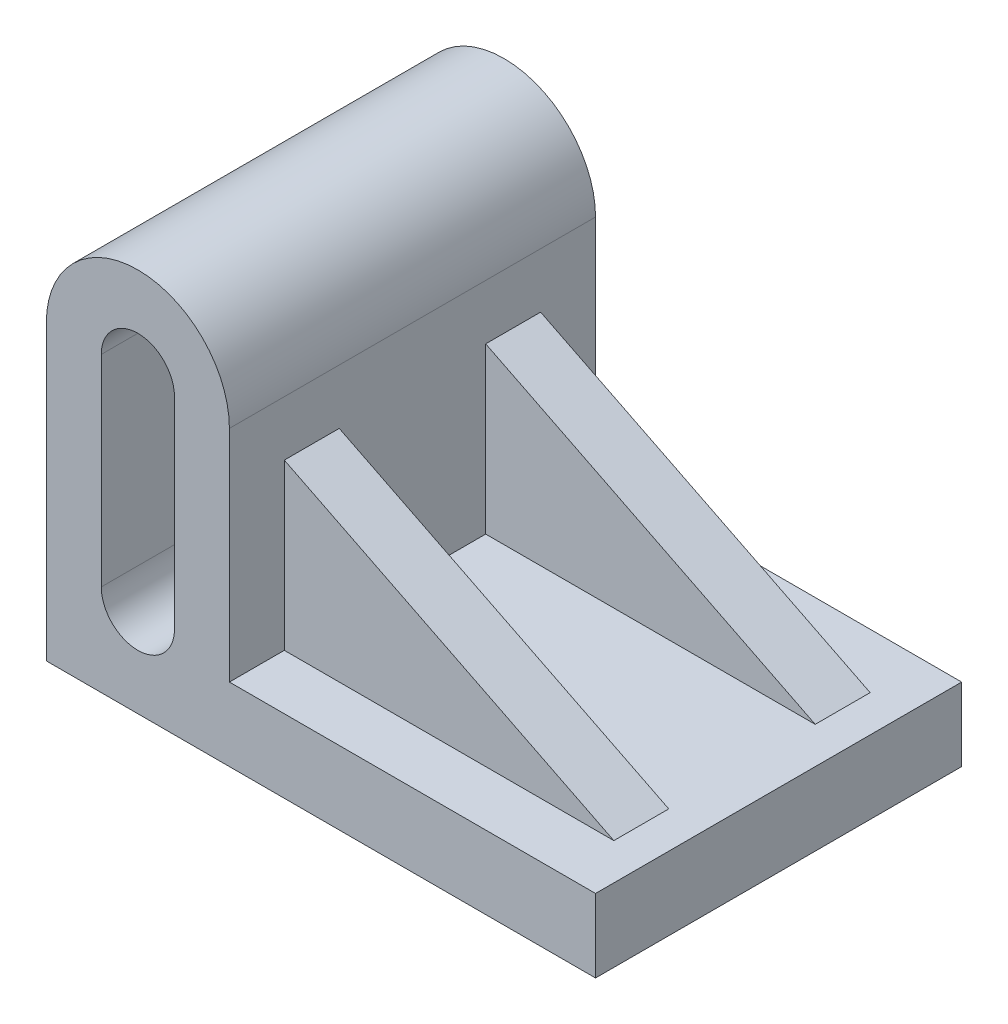
ISO-10303-21;
HEADER;
FILE_DESCRIPTION(('STEP AP214'),'2;1');
FILE_NAME('part.step','',(''),(''),'','','');
FILE_SCHEMA(('AUTOMOTIVE_DESIGN { 1 0 10303 214 1 1 1 1 }'));
ENDSEC;
DATA;
#1=APPLICATION_CONTEXT('core data for automotive mechanical design processes');
#2=APPLICATION_PROTOCOL_DEFINITION('international standard','automotive_design',2000,#1);
#3=PRODUCT_CONTEXT('',#1,'mechanical');
#4=PRODUCT('Part','Part','',(#3));
#5=PRODUCT_RELATED_PRODUCT_CATEGORY('part','',(#4));
#6=PRODUCT_DEFINITION_FORMATION('','',#4);
#7=PRODUCT_DEFINITION_CONTEXT('part definition',#1,'design');
#8=PRODUCT_DEFINITION('design','',#6,#7);
#9=PRODUCT_DEFINITION_SHAPE('','',#8);
#10=(LENGTH_UNIT() NAMED_UNIT(*) SI_UNIT(.MILLI.,.METRE.));
#11=(NAMED_UNIT(*) PLANE_ANGLE_UNIT() SI_UNIT($,.RADIAN.));
#12=(NAMED_UNIT(*) SI_UNIT($,.STERADIAN.) SOLID_ANGLE_UNIT());
#13=UNCERTAINTY_MEASURE_WITH_UNIT(LENGTH_MEASURE(1.E-05),#10,'distance_accuracy_value','');
#14=(GEOMETRIC_REPRESENTATION_CONTEXT(3) GLOBAL_UNCERTAINTY_ASSIGNED_CONTEXT((#13)) GLOBAL_UNIT_ASSIGNED_CONTEXT((#10,
#11,#12)) REPRESENTATION_CONTEXT('',''));
#15=CARTESIAN_POINT('',(0.,0.,0.));
#16=DIRECTION('',(0.,0.,1.));
#17=DIRECTION('',(1.,0.,0.));
#18=AXIS2_PLACEMENT_3D('',#15,#16,#17);
#19=CARTESIAN_POINT('',(140.,20.,-35.));
#20=DIRECTION('',(0.447213595499958,0.894427190999916,0.));
#21=DIRECTION('',(-0.894427190999916,0.447213595499958,0.));
#22=AXIS2_PLACEMENT_3D('',#19,#20,#21);
#23=PLANE('',#22);
#24=DIRECTION('',(0.,0.,1.));
#25=VECTOR('',#24,1.);
#26=CARTESIAN_POINT('',(140.,20.,-35.));
#27=LINE('',#26,#25);
#28=CARTESIAN_POINT('',(140.,20.,20.));
#29=VERTEX_POINT('',#28);
#30=CARTESIAN_POINT('',(140.,20.,35.));
#31=VERTEX_POINT('',#30);
#32=EDGE_CURVE('E208',#29,#31,#27,.T.);
#33=ORIENTED_EDGE('',*,*,#32,.F.);
#34=DIRECTION('',(-0.894427190999916,0.447213595499958,0.));
#35=VECTOR('',#34,1.);
#36=CARTESIAN_POINT('',(140.,20.,20.));
#37=LINE('',#36,#35);
#38=CARTESIAN_POINT('',(50.,65.,20.));
#39=VERTEX_POINT('',#38);
#40=EDGE_CURVE('E11',#29,#39,#37,.T.);
#41=ORIENTED_EDGE('',*,*,#40,.T.);
#42=DIRECTION('',(0.,0.,1.));
#43=VECTOR('',#42,1.);
#44=CARTESIAN_POINT('',(50.,65.,-35.));
#45=LINE('',#44,#43);
#46=CARTESIAN_POINT('',(50.,65.,35.));
#47=VERTEX_POINT('',#46);
#48=EDGE_CURVE('E162',#39,#47,#45,.T.);
#49=ORIENTED_EDGE('',*,*,#48,.T.);
#50=DIRECTION('',(-0.894427190999916,0.447213595499958,0.));
#51=VECTOR('',#50,1.);
#52=CARTESIAN_POINT('',(140.,20.,35.));
#53=LINE('',#52,#51);
#54=EDGE_CURVE('E165',#31,#47,#53,.T.);
#55=ORIENTED_EDGE('',*,*,#54,.F.);
#56=EDGE_LOOP('',(#33,#41,#49,#55));
#57=FACE_BOUND('',#56,.T.);
#58=ADVANCED_FACE('F43',(#57),#23,.T.);
#59=CARTESIAN_POINT('',(50.,65.,-35.));
#60=VERTEX_POINT('',#59);
#61=CARTESIAN_POINT('',(50.,65.,-20.));
#62=VERTEX_POINT('',#61);
#63=EDGE_CURVE('E67',#60,#62,#45,.T.);
#64=ORIENTED_EDGE('',*,*,#63,.T.);
#65=DIRECTION('',(0.894427190999916,-0.447213595499958,0.));
#66=VECTOR('',#65,1.);
#67=CARTESIAN_POINT('',(140.,20.,-20.));
#68=LINE('',#67,#66);
#69=CARTESIAN_POINT('',(140.,20.,-20.));
#70=VERTEX_POINT('',#69);
#71=EDGE_CURVE('E52',#62,#70,#68,.T.);
#72=ORIENTED_EDGE('',*,*,#71,.T.);
#73=CARTESIAN_POINT('',(140.,20.,-35.));
#74=VERTEX_POINT('',#73);
#75=EDGE_CURVE('E204',#74,#70,#27,.T.);
#76=ORIENTED_EDGE('',*,*,#75,.F.);
#77=DIRECTION('',(-0.894427190999916,0.447213595499958,0.));
#78=VECTOR('',#77,1.);
#79=CARTESIAN_POINT('',(140.,20.,-35.));
#80=LINE('',#79,#78);
#81=EDGE_CURVE('E194',#74,#60,#80,.T.);
#82=ORIENTED_EDGE('',*,*,#81,.T.);
#83=EDGE_LOOP('',(#64,#72,#76,#82));
#84=FACE_BOUND('',#83,.T.);
#85=ADVANCED_FACE('F325',(#84),#23,.T.);
#86=CARTESIAN_POINT('',(50.,20.,-50.));
#87=DIRECTION('',(1.,0.,0.));
#88=DIRECTION('',(0.,0.,-1.));
#89=AXIS2_PLACEMENT_3D('',#86,#87,#88);
#90=PLANE('',#89);
#91=DIRECTION('',(0.,0.,1.));
#92=VECTOR('',#91,1.);
#93=CARTESIAN_POINT('',(50.,80.,-50.));
#94=LINE('',#93,#92);
#95=CARTESIAN_POINT('',(50.,80.,-50.));
#96=VERTEX_POINT('',#95);
#97=CARTESIAN_POINT('',(50.,80.,50.));
#98=VERTEX_POINT('',#97);
#99=EDGE_CURVE('E306',#96,#98,#94,.T.);
#100=ORIENTED_EDGE('',*,*,#99,.T.);
#101=DIRECTION('',(0.,1.,0.));
#102=VECTOR('',#101,1.);
#103=CARTESIAN_POINT('',(50.,20.,50.));
#104=LINE('',#103,#102);
#105=CARTESIAN_POINT('',(50.,20.,50.));
#106=VERTEX_POINT('',#105);
#107=EDGE_CURVE('E270',#106,#98,#104,.T.);
#108=ORIENTED_EDGE('',*,*,#107,.F.);
#109=DIRECTION('',(0.,0.,1.));
#110=VECTOR('',#109,1.);
#111=CARTESIAN_POINT('',(50.,20.,-50.));
#112=LINE('',#111,#110);
#113=CARTESIAN_POINT('',(50.,20.,35.));
#114=VERTEX_POINT('',#113);
#115=EDGE_CURVE('E313',#114,#106,#112,.T.);
#116=ORIENTED_EDGE('',*,*,#115,.F.);
#117=DIRECTION('',(0.,-1.,0.));
#118=VECTOR('',#117,1.);
#119=CARTESIAN_POINT('',(50.,65.,35.));
#120=LINE('',#119,#118);
#121=EDGE_CURVE('E186',#47,#114,#120,.T.);
#122=ORIENTED_EDGE('',*,*,#121,.F.);
#123=ORIENTED_EDGE('',*,*,#48,.F.);
#124=DIRECTION('',(0.,-1.,0.));
#125=VECTOR('',#124,1.);
#126=CARTESIAN_POINT('',(50.,105.,20.));
#127=LINE('',#126,#125);
#128=CARTESIAN_POINT('',(50.,20.,20.));
#129=VERTEX_POINT('',#128);
#130=EDGE_CURVE('E158',#39,#129,#127,.T.);
#131=ORIENTED_EDGE('',*,*,#130,.T.);
#132=DIRECTION('',(0.,0.,1.));
#133=VECTOR('',#132,1.);
#134=CARTESIAN_POINT('',(50.,20.,-20.));
#135=LINE('',#134,#133);
#136=CARTESIAN_POINT('',(50.,20.,-20.));
#137=VERTEX_POINT('',#136);
#138=EDGE_CURVE('E160',#137,#129,#135,.T.);
#139=ORIENTED_EDGE('',*,*,#138,.F.);
#140=DIRECTION('',(0.,-1.,0.));
#141=VECTOR('',#140,1.);
#142=CARTESIAN_POINT('',(50.,105.,-20.));
#143=LINE('',#142,#141);
#144=EDGE_CURVE('E166',#62,#137,#143,.T.);
#145=ORIENTED_EDGE('',*,*,#144,.F.);
#146=ORIENTED_EDGE('',*,*,#63,.F.);
#147=DIRECTION('',(0.,-1.,0.));
#148=VECTOR('',#147,1.);
#149=CARTESIAN_POINT('',(50.,65.,-35.));
#150=LINE('',#149,#148);
#151=CARTESIAN_POINT('',(50.,20.,-35.));
#152=VERTEX_POINT('',#151);
#153=EDGE_CURVE('E198',#60,#152,#150,.T.);
#154=ORIENTED_EDGE('',*,*,#153,.T.);
#155=CARTESIAN_POINT('',(50.,20.,-50.));
#156=VERTEX_POINT('',#155);
#157=EDGE_CURVE('E309',#156,#152,#112,.T.);
#158=ORIENTED_EDGE('',*,*,#157,.F.);
#159=DIRECTION('',(0.,1.,0.));
#160=VECTOR('',#159,1.);
#161=CARTESIAN_POINT('',(50.,20.,-50.));
#162=LINE('',#161,#160);
#163=EDGE_CURVE('E294',#156,#96,#162,.T.);
#164=ORIENTED_EDGE('',*,*,#163,.T.);
#165=EDGE_LOOP('',(#100,#108,#116,#122,#123,#131,#139,#145,#146,#154,#158,#164));
#166=FACE_BOUND('',#165,.T.);
#167=ADVANCED_FACE('F159',(#166),#90,.T.);
#168=CARTESIAN_POINT('',(150.,20.,-50.));
#169=DIRECTION('',(0.,1.,0.));
#170=DIRECTION('',(-1.,0.,0.));
#171=AXIS2_PLACEMENT_3D('',#168,#169,#170);
#172=PLANE('',#171);
#173=DIRECTION('',(1.,0.,0.));
#174=VECTOR('',#173,1.);
#175=CARTESIAN_POINT('',(50.,20.,20.));
#176=LINE('',#175,#174);
#177=EDGE_CURVE('E59',#129,#29,#176,.T.);
#178=ORIENTED_EDGE('',*,*,#177,.T.);
#179=ORIENTED_EDGE('',*,*,#32,.T.);
#180=DIRECTION('',(1.,0.,0.));
#181=VECTOR('',#180,1.);
#182=CARTESIAN_POINT('',(50.,20.,35.));
#183=LINE('',#182,#181);
#184=EDGE_CURVE('E190',#114,#31,#183,.T.);
#185=ORIENTED_EDGE('',*,*,#184,.F.);
#186=ORIENTED_EDGE('',*,*,#115,.T.);
#187=DIRECTION('',(-1.,0.,0.));
#188=VECTOR('',#187,1.);
#189=CARTESIAN_POINT('',(150.,20.,50.));
#190=LINE('',#189,#188);
#191=CARTESIAN_POINT('',(150.,20.,50.));
#192=VERTEX_POINT('',#191);
#193=EDGE_CURVE('E266',#192,#106,#190,.T.);
#194=ORIENTED_EDGE('',*,*,#193,.F.);
#195=DIRECTION('',(0.,0.,1.));
#196=VECTOR('',#195,1.);
#197=CARTESIAN_POINT('',(150.,20.,-50.));
#198=LINE('',#197,#196);
#199=CARTESIAN_POINT('',(150.,20.,-50.));
#200=VERTEX_POINT('',#199);
#201=EDGE_CURVE('E314',#200,#192,#198,.T.);
#202=ORIENTED_EDGE('',*,*,#201,.F.);
#203=DIRECTION('',(-1.,0.,0.));
#204=VECTOR('',#203,1.);
#205=CARTESIAN_POINT('',(150.,20.,-50.));
#206=LINE('',#205,#204);
#207=EDGE_CURVE('E290',#200,#156,#206,.T.);
#208=ORIENTED_EDGE('',*,*,#207,.T.);
#209=ORIENTED_EDGE('',*,*,#157,.T.);
#210=DIRECTION('',(1.,0.,0.));
#211=VECTOR('',#210,1.);
#212=CARTESIAN_POINT('',(50.,20.,-35.));
#213=LINE('',#212,#211);
#214=EDGE_CURVE('E201',#152,#74,#213,.T.);
#215=ORIENTED_EDGE('',*,*,#214,.T.);
#216=ORIENTED_EDGE('',*,*,#75,.T.);
#217=DIRECTION('',(-1.,0.,0.));
#218=VECTOR('',#217,1.);
#219=CARTESIAN_POINT('',(50.,20.,-20.));
#220=LINE('',#219,#218);
#221=EDGE_CURVE('E171',#70,#137,#220,.T.);
#222=ORIENTED_EDGE('',*,*,#221,.T.);
#223=ORIENTED_EDGE('',*,*,#138,.T.);
#224=EDGE_LOOP('',(#178,#179,#185,#186,#194,#202,#208,#209,#215,#216,#222,#223));
#225=FACE_BOUND('',#224,.T.);
#226=ADVANCED_FACE('F174',(#225),#172,.T.);
#227=CARTESIAN_POINT('',(0.,80.,-50.));
#228=DIRECTION('',(-1.,0.,0.));
#229=DIRECTION('',(0.,-1.,0.));
#230=AXIS2_PLACEMENT_3D('',#227,#228,#229);
#231=PLANE('',#230);
#232=DIRECTION('',(0.,0.,1.));
#233=VECTOR('',#232,1.);
#234=CARTESIAN_POINT('',(0.,0.,-50.));
#235=LINE('',#234,#233);
#236=CARTESIAN_POINT('',(0.,0.,-50.));
#237=VERTEX_POINT('',#236);
#238=CARTESIAN_POINT('',(0.,0.,50.));
#239=VERTEX_POINT('',#238);
#240=EDGE_CURVE('E302',#237,#239,#235,.T.);
#241=ORIENTED_EDGE('',*,*,#240,.T.);
#242=DIRECTION('',(0.,-1.,0.));
#243=VECTOR('',#242,1.);
#244=CARTESIAN_POINT('',(0.,80.,50.));
#245=LINE('',#244,#243);
#246=CARTESIAN_POINT('',(0.,80.,50.));
#247=VERTEX_POINT('',#246);
#248=EDGE_CURVE('E245',#247,#239,#245,.T.);
#249=ORIENTED_EDGE('',*,*,#248,.F.);
#250=DIRECTION('',(0.,0.,1.));
#251=VECTOR('',#250,1.);
#252=CARTESIAN_POINT('',(0.,80.,-50.));
#253=LINE('',#252,#251);
#254=CARTESIAN_POINT('',(0.,80.,-50.));
#255=VERTEX_POINT('',#254);
#256=EDGE_CURVE('E303',#255,#247,#253,.T.);
#257=ORIENTED_EDGE('',*,*,#256,.F.);
#258=DIRECTION('',(0.,-1.,0.));
#259=VECTOR('',#258,1.);
#260=CARTESIAN_POINT('',(0.,80.,-50.));
#261=LINE('',#260,#259);
#262=EDGE_CURVE('E278',#255,#237,#261,.T.);
#263=ORIENTED_EDGE('',*,*,#262,.T.);
#264=EDGE_LOOP('',(#241,#249,#257,#263));
#265=FACE_BOUND('',#264,.T.);
#266=ADVANCED_FACE('F45',(#265),#231,.T.);
#267=CARTESIAN_POINT('',(25.,80.,-50.));
#268=DIRECTION('',(0.,0.,1.));
#269=DIRECTION('',(1.,0.,0.));
#270=AXIS2_PLACEMENT_3D('',#267,#268,#269);
#271=CYLINDRICAL_SURFACE('',#270,25.);
#272=ORIENTED_EDGE('',*,*,#256,.T.);
#273=CARTESIAN_POINT('',(25.,80.,50.));
#274=DIRECTION('',(0.,0.,1.));
#275=DIRECTION('',(1.,0.,0.));
#276=AXIS2_PLACEMENT_3D('',#273,#274,#275);
#277=CIRCLE('',#276,25.);
#278=EDGE_CURVE('E274',#98,#247,#277,.T.);
#279=ORIENTED_EDGE('',*,*,#278,.F.);
#280=ORIENTED_EDGE('',*,*,#99,.F.);
#281=CARTESIAN_POINT('',(25.,80.,-50.));
#282=DIRECTION('',(0.,0.,1.));
#283=DIRECTION('',(1.,0.,0.));
#284=AXIS2_PLACEMENT_3D('',#281,#282,#283);
#285=CIRCLE('',#284,25.);
#286=EDGE_CURVE('E298',#96,#255,#285,.T.);
#287=ORIENTED_EDGE('',*,*,#286,.T.);
#288=EDGE_LOOP('',(#272,#279,#280,#287));
#289=FACE_BOUND('',#288,.T.);
#290=ADVANCED_FACE('F353',(#289),#271,.T.);
#291=CARTESIAN_POINT('',(150.,0.,-50.));
#292=DIRECTION('',(1.,0.,0.));
#293=DIRECTION('',(0.,0.,-1.));
#294=AXIS2_PLACEMENT_3D('',#291,#292,#293);
#295=PLANE('',#294);
#296=ORIENTED_EDGE('',*,*,#201,.T.);
#297=DIRECTION('',(0.,1.,0.));
#298=VECTOR('',#297,1.);
#299=CARTESIAN_POINT('',(150.,0.,50.));
#300=LINE('',#299,#298);
#301=CARTESIAN_POINT('',(150.,0.,50.));
#302=VERTEX_POINT('',#301);
#303=EDGE_CURVE('E262',#302,#192,#300,.T.);
#304=ORIENTED_EDGE('',*,*,#303,.F.);
#305=DIRECTION('',(0.,0.,1.));
#306=VECTOR('',#305,1.);
#307=CARTESIAN_POINT('',(150.,0.,-50.));
#308=LINE('',#307,#306);
#309=CARTESIAN_POINT('',(150.,0.,-50.));
#310=VERTEX_POINT('',#309);
#311=EDGE_CURVE('E317',#310,#302,#308,.T.);
#312=ORIENTED_EDGE('',*,*,#311,.F.);
#313=DIRECTION('',(0.,1.,0.));
#314=VECTOR('',#313,1.);
#315=CARTESIAN_POINT('',(150.,0.,-50.));
#316=LINE('',#315,#314);
#317=EDGE_CURVE('E286',#310,#200,#316,.T.);
#318=ORIENTED_EDGE('',*,*,#317,.T.);
#319=EDGE_LOOP('',(#296,#304,#312,#318));
#320=FACE_BOUND('',#319,.T.);
#321=ADVANCED_FACE('F341',(#320),#295,.T.);
#322=CARTESIAN_POINT('',(0.,0.,-50.));
#323=DIRECTION('',(0.,-1.,0.));
#324=DIRECTION('',(0.,0.,-1.));
#325=AXIS2_PLACEMENT_3D('',#322,#323,#324);
#326=PLANE('',#325);
#327=ORIENTED_EDGE('',*,*,#311,.T.);
#328=DIRECTION('',(1.,0.,0.));
#329=VECTOR('',#328,1.);
#330=CARTESIAN_POINT('',(0.,0.,50.));
#331=LINE('',#330,#329);
#332=EDGE_CURVE('E258',#239,#302,#331,.T.);
#333=ORIENTED_EDGE('',*,*,#332,.F.);
#334=ORIENTED_EDGE('',*,*,#240,.F.);
#335=DIRECTION('',(1.,0.,0.));
#336=VECTOR('',#335,1.);
#337=CARTESIAN_POINT('',(0.,0.,-50.));
#338=LINE('',#337,#336);
#339=EDGE_CURVE('E282',#237,#310,#338,.T.);
#340=ORIENTED_EDGE('',*,*,#339,.T.);
#341=EDGE_LOOP('',(#327,#333,#334,#340));
#342=FACE_BOUND('',#341,.T.);
#343=ADVANCED_FACE('F348',(#342),#326,.T.);
#344=CARTESIAN_POINT('',(25.,80.,-50.));
#345=DIRECTION('',(0.,0.,1.));
#346=DIRECTION('',(1.,0.,0.));
#347=AXIS2_PLACEMENT_3D('',#344,#345,#346);
#348=PLANE('',#347);
#349=DIRECTION('',(0.,1.,0.));
#350=VECTOR('',#349,1.);
#351=CARTESIAN_POINT('',(35.,80.,-50.));
#352=LINE('',#351,#350);
#353=CARTESIAN_POINT('',(35.,25.,-50.));
#354=VERTEX_POINT('',#353);
#355=CARTESIAN_POINT('',(35.,80.,-50.));
#356=VERTEX_POINT('',#355);
#357=EDGE_CURVE('E224',#354,#356,#352,.T.);
#358=ORIENTED_EDGE('',*,*,#357,.T.);
#359=CARTESIAN_POINT('',(25.,80.,-50.));
#360=DIRECTION('',(0.,0.,1.));
#361=DIRECTION('',(1.,0.,0.));
#362=AXIS2_PLACEMENT_3D('',#359,#360,#361);
#363=CIRCLE('',#362,10.);
#364=CARTESIAN_POINT('',(15.,80.,-50.));
#365=VERTEX_POINT('',#364);
#366=EDGE_CURVE('E211',#356,#365,#363,.T.);
#367=ORIENTED_EDGE('',*,*,#366,.T.);
#368=DIRECTION('',(0.,-1.,0.));
#369=VECTOR('',#368,1.);
#370=CARTESIAN_POINT('',(15.,80.,-50.));
#371=LINE('',#370,#369);
#372=CARTESIAN_POINT('',(15.,25.,-50.));
#373=VERTEX_POINT('',#372);
#374=EDGE_CURVE('E215',#365,#373,#371,.T.);
#375=ORIENTED_EDGE('',*,*,#374,.T.);
#376=CARTESIAN_POINT('',(25.,25.,-50.));
#377=DIRECTION('',(0.,0.,1.));
#378=DIRECTION('',(1.,0.,0.));
#379=AXIS2_PLACEMENT_3D('',#376,#377,#378);
#380=CIRCLE('',#379,9.99999999999999);
#381=EDGE_CURVE('E220',#373,#354,#380,.T.);
#382=ORIENTED_EDGE('',*,*,#381,.T.);
#383=EDGE_LOOP('',(#358,#367,#375,#382));
#384=FACE_BOUND('',#383,.T.);
#385=ORIENTED_EDGE('',*,*,#262,.F.);
#386=ORIENTED_EDGE('',*,*,#286,.F.);
#387=ORIENTED_EDGE('',*,*,#163,.F.);
#388=ORIENTED_EDGE('',*,*,#207,.F.);
#389=ORIENTED_EDGE('',*,*,#317,.F.);
#390=ORIENTED_EDGE('',*,*,#339,.F.);
#391=EDGE_LOOP('',(#385,#386,#387,#388,#389,#390));
#392=FACE_BOUND('',#391,.T.);
#393=ADVANCED_FACE('F336',(#384,#392),#348,.F.);
#394=CARTESIAN_POINT('',(25.,80.,50.));
#395=DIRECTION('',(0.,0.,1.));
#396=DIRECTION('',(1.,0.,0.));
#397=AXIS2_PLACEMENT_3D('',#394,#395,#396);
#398=PLANE('',#397);
#399=CARTESIAN_POINT('',(25.,80.,50.));
#400=DIRECTION('',(0.,0.,1.));
#401=DIRECTION('',(1.,0.,0.));
#402=AXIS2_PLACEMENT_3D('',#399,#400,#401);
#403=CIRCLE('',#402,10.);
#404=CARTESIAN_POINT('',(35.,80.,50.));
#405=VERTEX_POINT('',#404);
#406=CARTESIAN_POINT('',(15.,80.,50.));
#407=VERTEX_POINT('',#406);
#408=EDGE_CURVE('E207',#405,#407,#403,.T.);
#409=ORIENTED_EDGE('',*,*,#408,.F.);
#410=DIRECTION('',(0.,1.,0.));
#411=VECTOR('',#410,1.);
#412=CARTESIAN_POINT('',(35.,80.,50.));
#413=LINE('',#412,#411);
#414=CARTESIAN_POINT('',(35.,25.,50.));
#415=VERTEX_POINT('',#414);
#416=EDGE_CURVE('E216',#415,#405,#413,.T.);
#417=ORIENTED_EDGE('',*,*,#416,.F.);
#418=CARTESIAN_POINT('',(25.,25.,50.));
#419=DIRECTION('',(0.,0.,1.));
#420=DIRECTION('',(1.,0.,0.));
#421=AXIS2_PLACEMENT_3D('',#418,#419,#420);
#422=CIRCLE('',#421,9.99999999999999);
#423=CARTESIAN_POINT('',(15.,25.,50.));
#424=VERTEX_POINT('',#423);
#425=EDGE_CURVE('E235',#424,#415,#422,.T.);
#426=ORIENTED_EDGE('',*,*,#425,.F.);
#427=DIRECTION('',(0.,-1.,0.));
#428=VECTOR('',#427,1.);
#429=CARTESIAN_POINT('',(15.,80.,50.));
#430=LINE('',#429,#428);
#431=EDGE_CURVE('E231',#407,#424,#430,.T.);
#432=ORIENTED_EDGE('',*,*,#431,.F.);
#433=EDGE_LOOP('',(#409,#417,#426,#432));
#434=FACE_BOUND('',#433,.T.);
#435=ORIENTED_EDGE('',*,*,#248,.T.);
#436=ORIENTED_EDGE('',*,*,#332,.T.);
#437=ORIENTED_EDGE('',*,*,#303,.T.);
#438=ORIENTED_EDGE('',*,*,#193,.T.);
#439=ORIENTED_EDGE('',*,*,#107,.T.);
#440=ORIENTED_EDGE('',*,*,#278,.T.);
#441=EDGE_LOOP('',(#435,#436,#437,#438,#439,#440));
#442=FACE_BOUND('',#441,.T.);
#443=ADVANCED_FACE('F343',(#434,#442),#398,.T.);
#444=CARTESIAN_POINT('',(25.,80.,-50.));
#445=DIRECTION('',(0.,0.,1.));
#446=DIRECTION('',(1.,0.,0.));
#447=AXIS2_PLACEMENT_3D('',#444,#445,#446);
#448=CYLINDRICAL_SURFACE('',#447,10.);
#449=ORIENTED_EDGE('',*,*,#408,.T.);
#450=DIRECTION('',(0.,0.,1.));
#451=VECTOR('',#450,1.);
#452=CARTESIAN_POINT('',(15.,80.,-50.));
#453=LINE('',#452,#451);
#454=EDGE_CURVE('E228',#365,#407,#453,.T.);
#455=ORIENTED_EDGE('',*,*,#454,.F.);
#456=ORIENTED_EDGE('',*,*,#366,.F.);
#457=DIRECTION('',(0.,0.,1.));
#458=VECTOR('',#457,1.);
#459=CARTESIAN_POINT('',(35.,80.,-50.));
#460=LINE('',#459,#458);
#461=EDGE_CURVE('E242',#356,#405,#460,.T.);
#462=ORIENTED_EDGE('',*,*,#461,.T.);
#463=EDGE_LOOP('',(#449,#455,#456,#462));
#464=FACE_BOUND('',#463,.T.);
#465=ADVANCED_FACE('F374',(#464),#448,.F.);
#466=CARTESIAN_POINT('',(35.,80.,-50.));
#467=DIRECTION('',(1.,0.,0.));
#468=DIRECTION('',(0.,1.,0.));
#469=AXIS2_PLACEMENT_3D('',#466,#467,#468);
#470=PLANE('',#469);
#471=ORIENTED_EDGE('',*,*,#416,.T.);
#472=ORIENTED_EDGE('',*,*,#461,.F.);
#473=ORIENTED_EDGE('',*,*,#357,.F.);
#474=DIRECTION('',(0.,0.,1.));
#475=VECTOR('',#474,1.);
#476=CARTESIAN_POINT('',(35.,25.,-50.));
#477=LINE('',#476,#475);
#478=EDGE_CURVE('E246',#354,#415,#477,.T.);
#479=ORIENTED_EDGE('',*,*,#478,.T.);
#480=EDGE_LOOP('',(#471,#472,#473,#479));
#481=FACE_BOUND('',#480,.T.);
#482=ADVANCED_FACE('F370',(#481),#470,.F.);
#483=CARTESIAN_POINT('',(25.,25.,-50.));
#484=DIRECTION('',(0.,0.,1.));
#485=DIRECTION('',(1.,0.,0.));
#486=AXIS2_PLACEMENT_3D('',#483,#484,#485);
#487=CYLINDRICAL_SURFACE('',#486,9.99999999999999);
#488=ORIENTED_EDGE('',*,*,#425,.T.);
#489=ORIENTED_EDGE('',*,*,#478,.F.);
#490=ORIENTED_EDGE('',*,*,#381,.F.);
#491=DIRECTION('',(0.,0.,1.));
#492=VECTOR('',#491,1.);
#493=CARTESIAN_POINT('',(15.,25.,-50.));
#494=LINE('',#493,#492);
#495=EDGE_CURVE('E249',#373,#424,#494,.T.);
#496=ORIENTED_EDGE('',*,*,#495,.T.);
#497=EDGE_LOOP('',(#488,#489,#490,#496));
#498=FACE_BOUND('',#497,.T.);
#499=ADVANCED_FACE('F373',(#498),#487,.F.);
#500=CARTESIAN_POINT('',(15.,80.,-50.));
#501=DIRECTION('',(-1.,0.,0.));
#502=DIRECTION('',(0.,-1.,0.));
#503=AXIS2_PLACEMENT_3D('',#500,#501,#502);
#504=PLANE('',#503);
#505=ORIENTED_EDGE('',*,*,#431,.T.);
#506=ORIENTED_EDGE('',*,*,#495,.F.);
#507=ORIENTED_EDGE('',*,*,#374,.F.);
#508=ORIENTED_EDGE('',*,*,#454,.T.);
#509=EDGE_LOOP('',(#505,#506,#507,#508));
#510=FACE_BOUND('',#509,.T.);
#511=ADVANCED_FACE('F378',(#510),#504,.F.);
#512=CARTESIAN_POINT('',(0.,0.,-35.));
#513=DIRECTION('',(0.,0.,1.));
#514=DIRECTION('',(1.,0.,0.));
#515=AXIS2_PLACEMENT_3D('',#512,#513,#514);
#516=PLANE('',#515);
#517=ORIENTED_EDGE('',*,*,#81,.F.);
#518=ORIENTED_EDGE('',*,*,#214,.F.);
#519=ORIENTED_EDGE('',*,*,#153,.F.);
#520=EDGE_LOOP('',(#517,#518,#519));
#521=FACE_BOUND('',#520,.T.);
#522=ADVANCED_FACE('F330',(#521),#516,.F.);
#523=CARTESIAN_POINT('',(0.,0.,35.));
#524=DIRECTION('',(0.,0.,1.));
#525=DIRECTION('',(1.,0.,0.));
#526=AXIS2_PLACEMENT_3D('',#523,#524,#525);
#527=PLANE('',#526);
#528=ORIENTED_EDGE('',*,*,#54,.T.);
#529=ORIENTED_EDGE('',*,*,#121,.T.);
#530=ORIENTED_EDGE('',*,*,#184,.T.);
#531=EDGE_LOOP('',(#528,#529,#530));
#532=FACE_BOUND('',#531,.T.);
#533=ADVANCED_FACE('F357',(#532),#527,.T.);
#534=CARTESIAN_POINT('',(50.,105.,20.));
#535=DIRECTION('',(0.,0.,-1.));
#536=DIRECTION('',(-1.,0.,0.));
#537=AXIS2_PLACEMENT_3D('',#534,#535,#536);
#538=PLANE('',#537);
#539=ORIENTED_EDGE('',*,*,#177,.F.);
#540=ORIENTED_EDGE('',*,*,#130,.F.);
#541=ORIENTED_EDGE('',*,*,#40,.F.);
#542=EDGE_LOOP('',(#539,#540,#541));
#543=FACE_BOUND('',#542,.T.);
#544=ADVANCED_FACE('F168',(#543),#538,.T.);
#545=CARTESIAN_POINT('',(50.,105.,-20.));
#546=DIRECTION('',(0.,0.,1.));
#547=DIRECTION('',(1.,0.,0.));
#548=AXIS2_PLACEMENT_3D('',#545,#546,#547);
#549=PLANE('',#548);
#550=ORIENTED_EDGE('',*,*,#144,.T.);
#551=ORIENTED_EDGE('',*,*,#221,.F.);
#552=ORIENTED_EDGE('',*,*,#71,.F.);
#553=EDGE_LOOP('',(#550,#551,#552));
#554=FACE_BOUND('',#553,.T.);
#555=ADVANCED_FACE('F445',(#554),#549,.T.);
#556=CLOSED_SHELL('',(#58,#85,#167,#226,#266,#290,#321,#343,#393,#443,#465,#482,#499,#511,#522,
#533,#544,#555));
#557=MANIFOLD_SOLID_BREP('B2',#556);
#558=ADVANCED_BREP_SHAPE_REPRESENTATION('',(#18,#557),#14);
#559=SHAPE_DEFINITION_REPRESENTATION(#9,#558);
ENDSEC;
END-ISO-10303-21;
